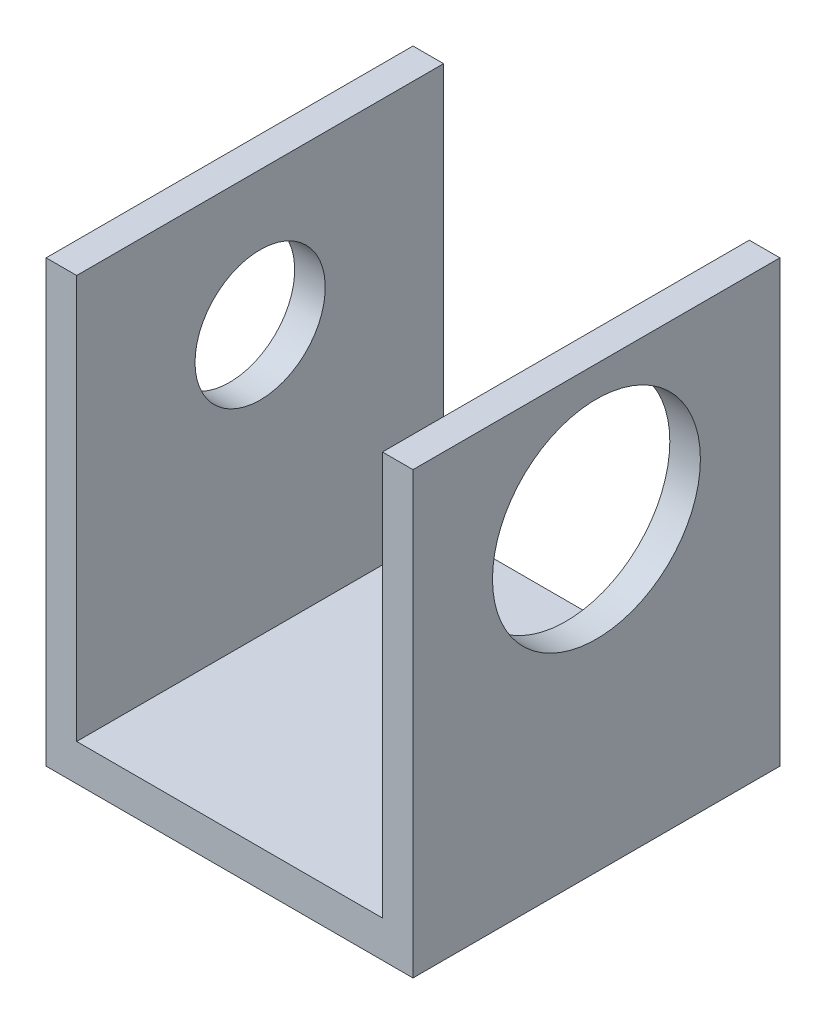
ISO-10303-21;
HEADER;
FILE_DESCRIPTION(('STEP AP214'),'2;1');
FILE_NAME('part.step','',(''),(''),'','','');
FILE_SCHEMA(('AUTOMOTIVE_DESIGN { 1 0 10303 214 1 1 1 1 }'));
ENDSEC;
DATA;
#1=APPLICATION_CONTEXT('core data for automotive mechanical design processes');
#2=APPLICATION_PROTOCOL_DEFINITION('international standard','automotive_design',2000,#1);
#3=PRODUCT_CONTEXT('',#1,'mechanical');
#4=PRODUCT('Part','Part','',(#3));
#5=PRODUCT_RELATED_PRODUCT_CATEGORY('part','',(#4));
#6=PRODUCT_DEFINITION_FORMATION('','',#4);
#7=PRODUCT_DEFINITION_CONTEXT('part definition',#1,'design');
#8=PRODUCT_DEFINITION('design','',#6,#7);
#9=PRODUCT_DEFINITION_SHAPE('','',#8);
#10=(LENGTH_UNIT() NAMED_UNIT(*) SI_UNIT(.MILLI.,.METRE.));
#11=(NAMED_UNIT(*) PLANE_ANGLE_UNIT() SI_UNIT($,.RADIAN.));
#12=(NAMED_UNIT(*) SI_UNIT($,.STERADIAN.) SOLID_ANGLE_UNIT());
#13=UNCERTAINTY_MEASURE_WITH_UNIT(LENGTH_MEASURE(1.E-05),#10,'distance_accuracy_value','');
#14=(GEOMETRIC_REPRESENTATION_CONTEXT(3) GLOBAL_UNCERTAINTY_ASSIGNED_CONTEXT((#13)) GLOBAL_UNIT_ASSIGNED_CONTEXT((#10,
#11,#12)) REPRESENTATION_CONTEXT('',''));
#15=CARTESIAN_POINT('',(0.,0.,0.));
#16=DIRECTION('',(0.,0.,1.));
#17=DIRECTION('',(1.,0.,0.));
#18=AXIS2_PLACEMENT_3D('',#15,#16,#17);
#19=CARTESIAN_POINT('',(-2.71887323943662,6.85218661971831,7.62));
#20=DIRECTION('',(0.,-1.,0.));
#21=DIRECTION('',(0.,0.,-1.));
#22=AXIS2_PLACEMENT_3D('',#19,#20,#21);
#23=PLANE('',#22);
#24=DIRECTION('',(-1.,0.,0.));
#25=VECTOR('',#24,1.);
#26=CARTESIAN_POINT('',(-2.71887323943662,6.85218661971831,0.));
#27=LINE('',#26,#25);
#28=CARTESIAN_POINT('',(-2.71887323943662,6.85218661971831,0.));
#29=VERTEX_POINT('',#28);
#30=CARTESIAN_POINT('',(-3.35387323943662,6.85218661971831,0.));
#31=VERTEX_POINT('',#30);
#32=EDGE_CURVE('E133',#29,#31,#27,.T.);
#33=ORIENTED_EDGE('',*,*,#32,.T.);
#34=DIRECTION('',(0.,0.,-1.));
#35=VECTOR('',#34,1.);
#36=CARTESIAN_POINT('',(-3.35387323943662,6.85218661971831,7.62));
#37=LINE('',#36,#35);
#38=CARTESIAN_POINT('',(-3.35387323943662,6.85218661971831,7.62));
#39=VERTEX_POINT('',#38);
#40=EDGE_CURVE('E11',#39,#31,#37,.T.);
#41=ORIENTED_EDGE('',*,*,#40,.F.);
#42=DIRECTION('',(-1.,0.,0.));
#43=VECTOR('',#42,1.);
#44=CARTESIAN_POINT('',(-2.71887323943662,6.85218661971831,7.62));
#45=LINE('',#44,#43);
#46=CARTESIAN_POINT('',(-2.71887323943662,6.85218661971831,7.62));
#47=VERTEX_POINT('',#46);
#48=EDGE_CURVE('E148',#47,#39,#45,.T.);
#49=ORIENTED_EDGE('',*,*,#48,.F.);
#50=DIRECTION('',(0.,0.,-1.));
#51=VECTOR('',#50,1.);
#52=CARTESIAN_POINT('',(-2.71887323943662,6.85218661971831,7.62));
#53=LINE('',#52,#51);
#54=EDGE_CURVE('E129',#47,#29,#53,.T.);
#55=ORIENTED_EDGE('',*,*,#54,.T.);
#56=EDGE_LOOP('',(#33,#41,#49,#55));
#57=FACE_BOUND('',#56,.T.);
#58=ADVANCED_FACE('F37',(#57),#23,.F.);
#59=CARTESIAN_POINT('',(-3.35387323943662,6.85218661971831,7.62));
#60=DIRECTION('',(1.,0.,0.));
#61=DIRECTION('',(0.,1.,0.));
#62=AXIS2_PLACEMENT_3D('',#59,#60,#61);
#63=PLANE('',#62);
#64=CARTESIAN_POINT('',(-3.35387323943662,4.05818661971831,3.81));
#65=DIRECTION('',(-1.,0.,0.));
#66=DIRECTION('',(0.,0.,1.));
#67=AXIS2_PLACEMENT_3D('',#64,#65,#66);
#68=CIRCLE('',#67,1.35254999999999);
#69=CARTESIAN_POINT('',(-3.35387323943662,4.05818661971831,5.16254999999999));
#70=VERTEX_POINT('',#69);
#71=EDGE_CURVE('E183',#70,#70,#68,.T.);
#72=ORIENTED_EDGE('',*,*,#71,.F.);
#73=EDGE_LOOP('',(#72));
#74=FACE_BOUND('',#73,.T.);
#75=DIRECTION('',(0.,-1.,0.));
#76=VECTOR('',#75,1.);
#77=CARTESIAN_POINT('',(-3.35387323943662,6.85218661971831,0.));
#78=LINE('',#77,#76);
#79=CARTESIAN_POINT('',(-3.35387323943662,-2.29181338028169,0.));
#80=VERTEX_POINT('',#79);
#81=EDGE_CURVE('E136',#31,#80,#78,.T.);
#82=ORIENTED_EDGE('',*,*,#81,.T.);
#83=DIRECTION('',(0.,0.,-1.));
#84=VECTOR('',#83,1.);
#85=CARTESIAN_POINT('',(-3.35387323943662,-2.29181338028169,7.62));
#86=LINE('',#85,#84);
#87=CARTESIAN_POINT('',(-3.35387323943662,-2.29181338028169,7.62));
#88=VERTEX_POINT('',#87);
#89=EDGE_CURVE('E45',#88,#80,#86,.T.);
#90=ORIENTED_EDGE('',*,*,#89,.F.);
#91=DIRECTION('',(0.,-1.,0.));
#92=VECTOR('',#91,1.);
#93=CARTESIAN_POINT('',(-3.35387323943662,6.85218661971831,7.62));
#94=LINE('',#93,#92);
#95=EDGE_CURVE('E96',#39,#88,#94,.T.);
#96=ORIENTED_EDGE('',*,*,#95,.F.);
#97=ORIENTED_EDGE('',*,*,#40,.T.);
#98=EDGE_LOOP('',(#82,#90,#96,#97));
#99=FACE_BOUND('',#98,.T.);
#100=ADVANCED_FACE('F205',(#74,#99),#63,.F.);
#101=CARTESIAN_POINT('',(-3.35387323943662,-2.29181338028169,7.62));
#102=DIRECTION('',(0.,1.,0.));
#103=DIRECTION('',(0.,0.,1.));
#104=AXIS2_PLACEMENT_3D('',#101,#102,#103);
#105=PLANE('',#104);
#106=DIRECTION('',(1.,0.,0.));
#107=VECTOR('',#106,1.);
#108=CARTESIAN_POINT('',(-3.35387323943662,-2.29181338028169,0.));
#109=LINE('',#108,#107);
#110=CARTESIAN_POINT('',(4.26612676056338,-2.29181338028169,0.));
#111=VERTEX_POINT('',#110);
#112=EDGE_CURVE('E139',#80,#111,#109,.T.);
#113=ORIENTED_EDGE('',*,*,#112,.T.);
#114=DIRECTION('',(0.,0.,-1.));
#115=VECTOR('',#114,1.);
#116=CARTESIAN_POINT('',(4.26612676056338,-2.29181338028169,7.62));
#117=LINE('',#116,#115);
#118=CARTESIAN_POINT('',(4.26612676056338,-2.29181338028169,7.62));
#119=VERTEX_POINT('',#118);
#120=EDGE_CURVE('E155',#119,#111,#117,.T.);
#121=ORIENTED_EDGE('',*,*,#120,.F.);
#122=DIRECTION('',(1.,0.,0.));
#123=VECTOR('',#122,1.);
#124=CARTESIAN_POINT('',(-3.35387323943662,-2.29181338028169,7.62));
#125=LINE('',#124,#123);
#126=EDGE_CURVE('E163',#88,#119,#125,.T.);
#127=ORIENTED_EDGE('',*,*,#126,.F.);
#128=ORIENTED_EDGE('',*,*,#89,.T.);
#129=EDGE_LOOP('',(#113,#121,#127,#128));
#130=FACE_BOUND('',#129,.T.);
#131=ADVANCED_FACE('F161',(#130),#105,.F.);
#132=CARTESIAN_POINT('',(4.26612676056338,-2.29181338028169,7.62));
#133=DIRECTION('',(-1.,0.,0.));
#134=DIRECTION('',(0.,-1.,0.));
#135=AXIS2_PLACEMENT_3D('',#132,#133,#134);
#136=PLANE('',#135);
#137=CARTESIAN_POINT('',(4.26612676056338,4.05818661971831,3.81));
#138=DIRECTION('',(1.,0.,0.));
#139=DIRECTION('',(0.,0.,-1.));
#140=AXIS2_PLACEMENT_3D('',#137,#138,#139);
#141=CIRCLE('',#140,2.159);
#142=CARTESIAN_POINT('',(4.26612676056338,4.05818661971831,1.651));
#143=VERTEX_POINT('',#142);
#144=EDGE_CURVE('E186',#143,#143,#141,.T.);
#145=ORIENTED_EDGE('',*,*,#144,.F.);
#146=EDGE_LOOP('',(#145));
#147=FACE_BOUND('',#146,.T.);
#148=DIRECTION('',(0.,1.,0.));
#149=VECTOR('',#148,1.);
#150=CARTESIAN_POINT('',(4.26612676056338,-2.29181338028169,0.));
#151=LINE('',#150,#149);
#152=CARTESIAN_POINT('',(4.26612676056338,6.85218661971831,0.));
#153=VERTEX_POINT('',#152);
#154=EDGE_CURVE('E141',#111,#153,#151,.T.);
#155=ORIENTED_EDGE('',*,*,#154,.T.);
#156=DIRECTION('',(0.,0.,-1.));
#157=VECTOR('',#156,1.);
#158=CARTESIAN_POINT('',(4.26612676056338,6.85218661971831,7.62));
#159=LINE('',#158,#157);
#160=CARTESIAN_POINT('',(4.26612676056338,6.85218661971831,7.62));
#161=VERTEX_POINT('',#160);
#162=EDGE_CURVE('E152',#161,#153,#159,.T.);
#163=ORIENTED_EDGE('',*,*,#162,.F.);
#164=DIRECTION('',(0.,1.,0.));
#165=VECTOR('',#164,1.);
#166=CARTESIAN_POINT('',(4.26612676056338,-2.29181338028169,7.62));
#167=LINE('',#166,#165);
#168=EDGE_CURVE('E175',#119,#161,#167,.T.);
#169=ORIENTED_EDGE('',*,*,#168,.F.);
#170=ORIENTED_EDGE('',*,*,#120,.T.);
#171=EDGE_LOOP('',(#155,#163,#169,#170));
#172=FACE_BOUND('',#171,.T.);
#173=ADVANCED_FACE('F171',(#147,#172),#136,.F.);
#174=CARTESIAN_POINT('',(3.63112676056338,6.85218661971831,7.62));
#175=DIRECTION('',(0.,-1.,0.));
#176=DIRECTION('',(0.,0.,-1.));
#177=AXIS2_PLACEMENT_3D('',#174,#175,#176);
#178=PLANE('',#177);
#179=DIRECTION('',(-1.,0.,0.));
#180=VECTOR('',#179,1.);
#181=CARTESIAN_POINT('',(3.63112676056338,6.85218661971831,0.));
#182=LINE('',#181,#180);
#183=CARTESIAN_POINT('',(3.63112676056338,6.85218661971831,0.));
#184=VERTEX_POINT('',#183);
#185=EDGE_CURVE('E143',#153,#184,#182,.T.);
#186=ORIENTED_EDGE('',*,*,#185,.T.);
#187=DIRECTION('',(0.,0.,-1.));
#188=VECTOR('',#187,1.);
#189=CARTESIAN_POINT('',(3.63112676056338,6.85218661971831,7.62));
#190=LINE('',#189,#188);
#191=CARTESIAN_POINT('',(3.63112676056338,6.85218661971831,7.62));
#192=VERTEX_POINT('',#191);
#193=EDGE_CURVE('E124',#192,#184,#190,.T.);
#194=ORIENTED_EDGE('',*,*,#193,.F.);
#195=DIRECTION('',(-1.,0.,0.));
#196=VECTOR('',#195,1.);
#197=CARTESIAN_POINT('',(3.63112676056338,6.85218661971831,7.62));
#198=LINE('',#197,#196);
#199=EDGE_CURVE('E115',#161,#192,#198,.T.);
#200=ORIENTED_EDGE('',*,*,#199,.F.);
#201=ORIENTED_EDGE('',*,*,#162,.T.);
#202=EDGE_LOOP('',(#186,#194,#200,#201));
#203=FACE_BOUND('',#202,.T.);
#204=ADVANCED_FACE('F174',(#203),#178,.F.);
#205=CARTESIAN_POINT('',(3.63112676056338,6.85218661971831,7.62));
#206=DIRECTION('',(1.,0.,0.));
#207=DIRECTION('',(0.,1.,0.));
#208=AXIS2_PLACEMENT_3D('',#205,#206,#207);
#209=PLANE('',#208);
#210=CARTESIAN_POINT('',(3.63112676056338,4.05818661971831,3.81));
#211=DIRECTION('',(1.,0.,0.));
#212=DIRECTION('',(0.,1.,0.));
#213=AXIS2_PLACEMENT_3D('',#210,#211,#212);
#214=CIRCLE('',#213,2.159);
#215=CARTESIAN_POINT('',(3.63112676056338,6.21718661971831,3.81));
#216=VERTEX_POINT('',#215);
#217=EDGE_CURVE('E189',#216,#216,#214,.F.);
#218=ORIENTED_EDGE('',*,*,#217,.F.);
#219=EDGE_LOOP('',(#218));
#220=FACE_BOUND('',#219,.T.);
#221=DIRECTION('',(0.,-1.,0.));
#222=VECTOR('',#221,1.);
#223=CARTESIAN_POINT('',(3.63112676056338,6.85218661971831,0.));
#224=LINE('',#223,#222);
#225=CARTESIAN_POINT('',(3.63112676056338,-1.52981338028169,0.));
#226=VERTEX_POINT('',#225);
#227=EDGE_CURVE('E123',#184,#226,#224,.T.);
#228=ORIENTED_EDGE('',*,*,#227,.T.);
#229=DIRECTION('',(0.,0.,-1.));
#230=VECTOR('',#229,1.);
#231=CARTESIAN_POINT('',(3.63112676056338,-1.52981338028169,7.62));
#232=LINE('',#231,#230);
#233=CARTESIAN_POINT('',(3.63112676056338,-1.52981338028169,7.62));
#234=VERTEX_POINT('',#233);
#235=EDGE_CURVE('E120',#234,#226,#232,.T.);
#236=ORIENTED_EDGE('',*,*,#235,.F.);
#237=DIRECTION('',(0.,-1.,0.));
#238=VECTOR('',#237,1.);
#239=CARTESIAN_POINT('',(3.63112676056338,6.85218661971831,7.62));
#240=LINE('',#239,#238);
#241=EDGE_CURVE('E109',#192,#234,#240,.T.);
#242=ORIENTED_EDGE('',*,*,#241,.F.);
#243=ORIENTED_EDGE('',*,*,#193,.T.);
#244=EDGE_LOOP('',(#228,#236,#242,#243));
#245=FACE_BOUND('',#244,.T.);
#246=ADVANCED_FACE('F121',(#220,#245),#209,.F.);
#247=CARTESIAN_POINT('',(3.63112676056338,-1.52981338028169,7.62));
#248=DIRECTION('',(0.,-1.,0.));
#249=DIRECTION('',(1.,0.,0.));
#250=AXIS2_PLACEMENT_3D('',#247,#248,#249);
#251=PLANE('',#250);
#252=DIRECTION('',(-1.,0.,0.));
#253=VECTOR('',#252,1.);
#254=CARTESIAN_POINT('',(3.63112676056338,-1.52981338028169,0.));
#255=LINE('',#254,#253);
#256=CARTESIAN_POINT('',(-2.71887323943662,-1.52981338028169,0.));
#257=VERTEX_POINT('',#256);
#258=EDGE_CURVE('E82',#226,#257,#255,.T.);
#259=ORIENTED_EDGE('',*,*,#258,.T.);
#260=DIRECTION('',(0.,0.,-1.));
#261=VECTOR('',#260,1.);
#262=CARTESIAN_POINT('',(-2.71887323943662,-1.52981338028169,7.62));
#263=LINE('',#262,#261);
#264=CARTESIAN_POINT('',(-2.71887323943662,-1.52981338028169,7.62));
#265=VERTEX_POINT('',#264);
#266=EDGE_CURVE('E125',#265,#257,#263,.T.);
#267=ORIENTED_EDGE('',*,*,#266,.F.);
#268=DIRECTION('',(-1.,0.,0.));
#269=VECTOR('',#268,1.);
#270=CARTESIAN_POINT('',(3.63112676056338,-1.52981338028169,7.62));
#271=LINE('',#270,#269);
#272=EDGE_CURVE('E113',#234,#265,#271,.T.);
#273=ORIENTED_EDGE('',*,*,#272,.F.);
#274=ORIENTED_EDGE('',*,*,#235,.T.);
#275=EDGE_LOOP('',(#259,#267,#273,#274));
#276=FACE_BOUND('',#275,.T.);
#277=ADVANCED_FACE('F127',(#276),#251,.F.);
#278=CARTESIAN_POINT('',(-2.71887323943662,-1.52981338028169,7.62));
#279=DIRECTION('',(-1.,0.,0.));
#280=DIRECTION('',(0.,-1.,0.));
#281=AXIS2_PLACEMENT_3D('',#278,#279,#280);
#282=PLANE('',#281);
#283=CARTESIAN_POINT('',(-2.71887323943662,4.05818661971831,3.81));
#284=DIRECTION('',(-1.,0.,0.));
#285=DIRECTION('',(0.,-1.,0.));
#286=AXIS2_PLACEMENT_3D('',#283,#284,#285);
#287=CIRCLE('',#286,1.35254999999999);
#288=CARTESIAN_POINT('',(-2.71887323943662,2.70563661971832,3.81));
#289=VERTEX_POINT('',#288);
#290=EDGE_CURVE('E137',#289,#289,#287,.T.);
#291=ORIENTED_EDGE('',*,*,#290,.T.);
#292=EDGE_LOOP('',(#291));
#293=FACE_BOUND('',#292,.T.);
#294=DIRECTION('',(0.,1.,0.));
#295=VECTOR('',#294,1.);
#296=CARTESIAN_POINT('',(-2.71887323943662,-1.52981338028169,0.));
#297=LINE('',#296,#295);
#298=EDGE_CURVE('E88',#257,#29,#297,.T.);
#299=ORIENTED_EDGE('',*,*,#298,.T.);
#300=ORIENTED_EDGE('',*,*,#54,.F.);
#301=DIRECTION('',(0.,1.,0.));
#302=VECTOR('',#301,1.);
#303=CARTESIAN_POINT('',(-2.71887323943662,-1.52981338028169,7.62));
#304=LINE('',#303,#302);
#305=EDGE_CURVE('E53',#265,#47,#304,.T.);
#306=ORIENTED_EDGE('',*,*,#305,.F.);
#307=ORIENTED_EDGE('',*,*,#266,.T.);
#308=EDGE_LOOP('',(#299,#300,#306,#307));
#309=FACE_BOUND('',#308,.T.);
#310=ADVANCED_FACE('F201',(#293,#309),#282,.F.);
#311=CARTESIAN_POINT('',(0.,0.,7.62));
#312=DIRECTION('',(0.,0.,1.));
#313=DIRECTION('',(1.,0.,0.));
#314=AXIS2_PLACEMENT_3D('',#311,#312,#313);
#315=PLANE('',#314);
#316=ORIENTED_EDGE('',*,*,#48,.T.);
#317=ORIENTED_EDGE('',*,*,#95,.T.);
#318=ORIENTED_EDGE('',*,*,#126,.T.);
#319=ORIENTED_EDGE('',*,*,#168,.T.);
#320=ORIENTED_EDGE('',*,*,#199,.T.);
#321=ORIENTED_EDGE('',*,*,#241,.T.);
#322=ORIENTED_EDGE('',*,*,#272,.T.);
#323=ORIENTED_EDGE('',*,*,#305,.T.);
#324=EDGE_LOOP('',(#316,#317,#318,#319,#320,#321,#322,#323));
#325=FACE_BOUND('',#324,.T.);
#326=ADVANCED_FACE('F111',(#325),#315,.T.);
#327=CARTESIAN_POINT('',(0.,0.,0.));
#328=DIRECTION('',(0.,0.,1.));
#329=DIRECTION('',(1.,0.,0.));
#330=AXIS2_PLACEMENT_3D('',#327,#328,#329);
#331=PLANE('',#330);
#332=ORIENTED_EDGE('',*,*,#32,.F.);
#333=ORIENTED_EDGE('',*,*,#298,.F.);
#334=ORIENTED_EDGE('',*,*,#258,.F.);
#335=ORIENTED_EDGE('',*,*,#227,.F.);
#336=ORIENTED_EDGE('',*,*,#185,.F.);
#337=ORIENTED_EDGE('',*,*,#154,.F.);
#338=ORIENTED_EDGE('',*,*,#112,.F.);
#339=ORIENTED_EDGE('',*,*,#81,.F.);
#340=EDGE_LOOP('',(#332,#333,#334,#335,#336,#337,#338,#339));
#341=FACE_BOUND('',#340,.T.);
#342=ADVANCED_FACE('F167',(#341),#331,.F.);
#343=CARTESIAN_POINT('',(-3.35387323943662,4.05818661971831,3.81));
#344=DIRECTION('',(-1.,0.,0.));
#345=DIRECTION('',(0.,0.,1.));
#346=AXIS2_PLACEMENT_3D('',#343,#344,#345);
#347=CYLINDRICAL_SURFACE('',#346,1.35254999999999);
#348=ORIENTED_EDGE('',*,*,#290,.F.);
#349=EDGE_LOOP('',(#348));
#350=FACE_BOUND('',#349,.T.);
#351=ORIENTED_EDGE('',*,*,#71,.T.);
#352=EDGE_LOOP('',(#351));
#353=FACE_BOUND('',#352,.T.);
#354=ADVANCED_FACE('F222',(#350,#353),#347,.F.);
#355=CARTESIAN_POINT('',(-3.35487323943662,4.05818661971831,3.81));
#356=DIRECTION('',(1.,0.,0.));
#357=DIRECTION('',(0.,0.,-1.));
#358=AXIS2_PLACEMENT_3D('',#355,#356,#357);
#359=CYLINDRICAL_SURFACE('',#358,2.159);
#360=ORIENTED_EDGE('',*,*,#144,.T.);
#361=EDGE_LOOP('',(#360));
#362=FACE_BOUND('',#361,.T.);
#363=ORIENTED_EDGE('',*,*,#217,.T.);
#364=EDGE_LOOP('',(#363));
#365=FACE_BOUND('',#364,.T.);
#366=ADVANCED_FACE('F193',(#362,#365),#359,.F.);
#367=CLOSED_SHELL('',(#58,#100,#131,#173,#204,#246,#277,#310,#326,#342,#354,#366));
#368=MANIFOLD_SOLID_BREP('B2',#367);
#369=ADVANCED_BREP_SHAPE_REPRESENTATION('',(#18,#368),#14);
#370=SHAPE_DEFINITION_REPRESENTATION(#9,#369);
ENDSEC;
END-ISO-10303-21;
